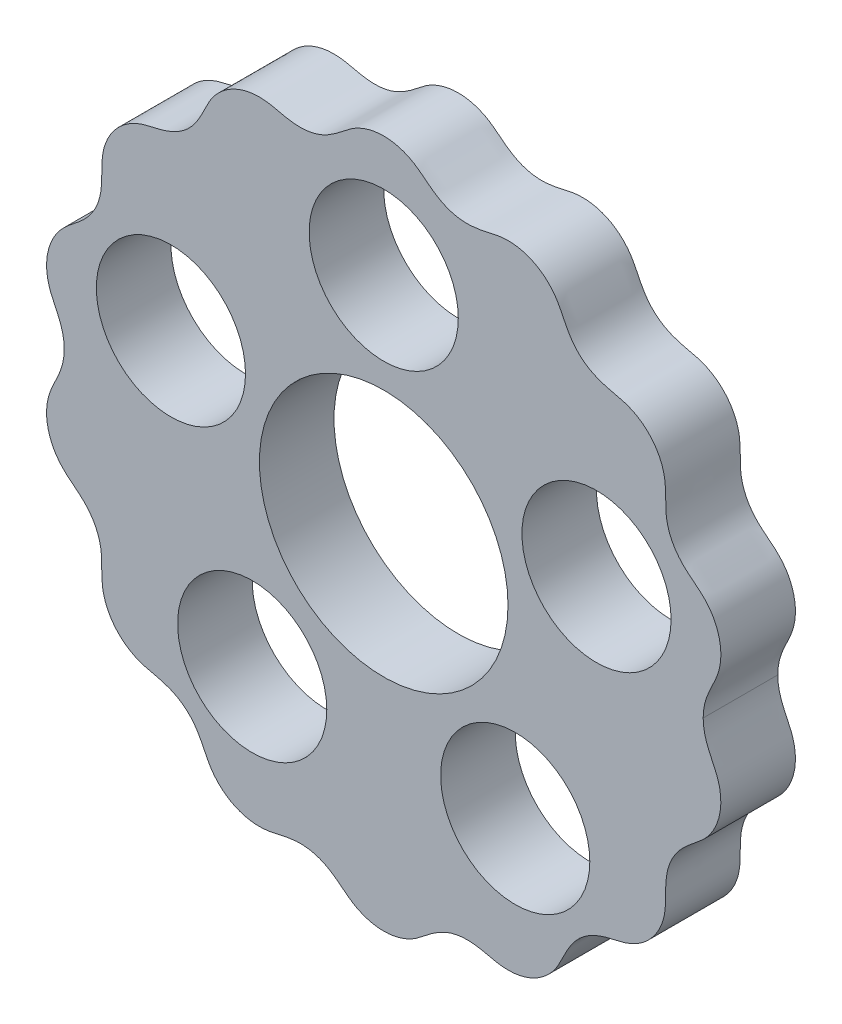
ISO-10303-21;
HEADER;
FILE_DESCRIPTION(('STEP AP214'),'2;1');
FILE_NAME('part.step','',(''),(''),'','','');
FILE_SCHEMA(('AUTOMOTIVE_DESIGN { 1 0 10303 214 1 1 1 1 }'));
ENDSEC;
DATA;
#1=APPLICATION_CONTEXT('core data for automotive mechanical design processes');
#2=APPLICATION_PROTOCOL_DEFINITION('international standard','automotive_design',2000,#1);
#3=PRODUCT_CONTEXT('',#1,'mechanical');
#4=PRODUCT('Part','Part','',(#3));
#5=PRODUCT_RELATED_PRODUCT_CATEGORY('part','',(#4));
#6=PRODUCT_DEFINITION_FORMATION('','',#4);
#7=PRODUCT_DEFINITION_CONTEXT('part definition',#1,'design');
#8=PRODUCT_DEFINITION('design','',#6,#7);
#9=PRODUCT_DEFINITION_SHAPE('','',#8);
#10=(LENGTH_UNIT() NAMED_UNIT(*) SI_UNIT(.MILLI.,.METRE.));
#11=(NAMED_UNIT(*) PLANE_ANGLE_UNIT() SI_UNIT($,.RADIAN.));
#12=(NAMED_UNIT(*) SI_UNIT($,.STERADIAN.) SOLID_ANGLE_UNIT());
#13=UNCERTAINTY_MEASURE_WITH_UNIT(LENGTH_MEASURE(1.E-05),#10,'distance_accuracy_value','');
#14=(GEOMETRIC_REPRESENTATION_CONTEXT(3) GLOBAL_UNCERTAINTY_ASSIGNED_CONTEXT((#13)) GLOBAL_UNIT_ASSIGNED_CONTEXT((#10,
#11,#12)) REPRESENTATION_CONTEXT('',''));
#15=CARTESIAN_POINT('',(0.,0.,0.));
#16=DIRECTION('',(0.,0.,1.));
#17=DIRECTION('',(1.,0.,0.));
#18=AXIS2_PLACEMENT_3D('',#15,#16,#17);
#19=CARTESIAN_POINT('',(-3.08116693157312E-05,14.0000331582625,3.));
#20=DIRECTION('',(0.,0.,1.));
#21=DIRECTION('',(1.,0.,0.));
#22=AXIS2_PLACEMENT_3D('',#19,#20,#21);
#23=PLANE('',#22);
#24=CARTESIAN_POINT('',(0.,0.,3.));
#25=DIRECTION('',(0.,0.,1.));
#26=DIRECTION('',(1.,0.,0.));
#27=AXIS2_PLACEMENT_3D('',#24,#25,#26);
#28=CIRCLE('',#27,5.);
#29=CARTESIAN_POINT('',(5.,0.,3.));
#30=VERTEX_POINT('',#29);
#31=EDGE_CURVE('E105',#30,#30,#28,.T.);
#32=ORIENTED_EDGE('',*,*,#31,.F.);
#33=EDGE_LOOP('',(#32));
#34=FACE_BOUND('',#33,.T.);
#35=CARTESIAN_POINT('',(-8.55950864665612,2.78115294937416,3.));
#36=DIRECTION('',(0.,0.,1.));
#37=DIRECTION('',(1.,0.,0.));
#38=AXIS2_PLACEMENT_3D('',#35,#36,#37);
#39=CIRCLE('',#38,3.00000000000046);
#40=CARTESIAN_POINT('',(-5.55950864665566,2.78115294937416,3.));
#41=VERTEX_POINT('',#40);
#42=EDGE_CURVE('E99',#41,#41,#39,.T.);
#43=ORIENTED_EDGE('',*,*,#42,.F.);
#44=EDGE_LOOP('',(#43));
#45=FACE_BOUND('',#44,.T.);
#46=CARTESIAN_POINT('',(-5.29006727063157,-7.28115294937475,3.));
#47=DIRECTION('',(0.,0.,1.));
#48=DIRECTION('',(1.,0.,0.));
#49=AXIS2_PLACEMENT_3D('',#46,#47,#48);
#50=CIRCLE('',#49,3.0000000000008);
#51=CARTESIAN_POINT('',(-2.29006727063076,-7.28115294937475,3.));
#52=VERTEX_POINT('',#51);
#53=EDGE_CURVE('E130',#52,#52,#50,.T.);
#54=ORIENTED_EDGE('',*,*,#53,.F.);
#55=EDGE_LOOP('',(#54));
#56=FACE_BOUND('',#55,.T.);
#57=CARTESIAN_POINT('',(5.29006727063295,-7.2811529493743,3.));
#58=DIRECTION('',(0.,0.,1.));
#59=DIRECTION('',(1.,0.,0.));
#60=AXIS2_PLACEMENT_3D('',#57,#58,#59);
#61=CIRCLE('',#60,3.00000000000065);
#62=CARTESIAN_POINT('',(8.2900672706336,-7.2811529493743,3.));
#63=VERTEX_POINT('',#62);
#64=EDGE_CURVE('E122',#63,#63,#61,.T.);
#65=ORIENTED_EDGE('',*,*,#64,.F.);
#66=EDGE_LOOP('',(#65));
#67=FACE_BOUND('',#66,.T.);
#68=CARTESIAN_POINT('',(8.55950864665665,2.78115294937489,3.));
#69=DIRECTION('',(0.,0.,1.));
#70=DIRECTION('',(1.,0.,0.));
#71=AXIS2_PLACEMENT_3D('',#68,#69,#70);
#72=CIRCLE('',#71,3.00000000000017);
#73=CARTESIAN_POINT('',(11.5595086466568,2.78115294937489,3.));
#74=VERTEX_POINT('',#73);
#75=EDGE_CURVE('E114',#74,#74,#72,.T.);
#76=ORIENTED_EDGE('',*,*,#75,.F.);
#77=EDGE_LOOP('',(#76));
#78=FACE_BOUND('',#77,.T.);
#79=CARTESIAN_POINT('',(0.,9.,3.));
#80=DIRECTION('',(0.,0.,1.));
#81=DIRECTION('',(1.,0.,0.));
#82=AXIS2_PLACEMENT_3D('',#79,#80,#81);
#83=CIRCLE('',#82,3.);
#84=CARTESIAN_POINT('',(3.,9.,3.));
#85=VERTEX_POINT('',#84);
#86=EDGE_CURVE('E106',#85,#85,#83,.T.);
#87=ORIENTED_EDGE('',*,*,#86,.F.);
#88=EDGE_LOOP('',(#87));
#89=FACE_BOUND('',#88,.T.);
#90=CARTESIAN_POINT('',(-12.8500539384113,3.2306380297552E-12,3.));
#91=CARTESIAN_POINT('',(-12.8501628034038,-0.251481730637626,3.));
#92=CARTESIAN_POINT('',(-12.9400474514801,-0.76310762027659,3.));
#93=CARTESIAN_POINT('',(-13.2805476403468,-1.41673948176034,3.));
#94=CARTESIAN_POINT('',(-13.5334321090351,-2.03483431866077,3.));
#95=CARTESIAN_POINT('',(-13.6076245667252,-2.93149089406617,3.));
#96=CARTESIAN_POINT('',(-13.2933938567163,-3.80527571125432,3.));
#97=CARTESIAN_POINT('',(-12.6605053360641,-4.43011602656103,3.));
#98=CARTESIAN_POINT('',(-12.0700648095173,-4.85369699253959,3.));
#99=CARTESIAN_POINT('',(-11.5876773534212,-5.45683704969,3.));
#100=CARTESIAN_POINT('',(-11.3410601378615,-6.19110966412462,3.));
#101=CARTESIAN_POINT('',(-11.3426921117736,-6.93908053862046,3.));
#102=CARTESIAN_POINT('',(-11.3249212347839,-7.83591629918584,3.));
#103=CARTESIAN_POINT('',(-10.9032517990377,-8.6615297114612,3.));
#104=CARTESIAN_POINT('',(-10.1990762092321,-9.22106105798793,3.));
#105=CARTESIAN_POINT('',(-9.57988602752918,-9.46558919607509,3.));
#106=CARTESIAN_POINT('',(-8.8743069151491,-9.58415587618986,3.));
#107=CARTESIAN_POINT('',(-8.16451400114808,-9.88121416338336,3.));
#108=CARTESIAN_POINT('',(-7.59578704025636,-10.40855055947,3.));
#109=CARTESIAN_POINT('',(-7.24503937718047,-11.0771175069884,3.));
#110=CARTESIAN_POINT('',(-6.95964434383805,-11.6950321768976,3.));
#111=CARTESIAN_POINT('',(-6.5083317362442,-12.1943494941639,3.));
#112=CARTESIAN_POINT('',(-5.93581020323511,-12.5476798211753,3.));
#113=CARTESIAN_POINT('',(-5.28455965408979,-12.7230486161861,3.));
#114=CARTESIAN_POINT('',(-4.61719389365255,-12.7053416228603,3.));
#115=CARTESIAN_POINT('',(-3.94146149406678,-12.5115412972718,3.));
#116=CARTESIAN_POINT('',(-3.17941960593419,-12.4337616023541,3.));
#117=CARTESIAN_POINT('',(-2.42760321440168,-12.6250982152148,3.));
#118=CARTESIAN_POINT('',(-1.7979347419707,-13.0528104572931,3.));
#119=CARTESIAN_POINT('',(-1.2758890835264,-13.5054681138031,3.));
#120=CARTESIAN_POINT('',(-0.666390526633137,-13.785149496984,3.));
#121=CARTESIAN_POINT('',(-0.000146267984430784,-13.8824446995189,3.));
#122=CARTESIAN_POINT('',(0.66667516187485,-13.7852706619507,3.));
#123=CARTESIAN_POINT('',(1.27583739817449,-13.5051733409832,3.));
#124=CARTESIAN_POINT('',(1.79722160324051,-13.0528774215565,3.));
#125=CARTESIAN_POINT('',(2.42799364198644,-12.6252037864453,3.));
#126=CARTESIAN_POINT('',(3.17921525063209,-12.4339751520003,3.));
#127=CARTESIAN_POINT('',(3.9420137854354,-12.510868897191,3.));
#128=CARTESIAN_POINT('',(4.61664296077039,-12.7053845168574,3.));
#129=CARTESIAN_POINT('',(5.28457042550126,-12.7232475423124,3.));
#130=CARTESIAN_POINT('',(5.93590214911907,-12.5475086934171,3.));
#131=CARTESIAN_POINT('',(6.50827069291037,-12.1944470417929,3.));
#132=CARTESIAN_POINT('',(6.9596570102471,-11.6950099245245,3.));
#133=CARTESIAN_POINT('',(7.24505030159331,-11.0771025817506,3.));
#134=CARTESIAN_POINT('',(7.59578230189097,-10.4085603087042,3.));
#135=CARTESIAN_POINT('',(8.16451673907484,-9.88119700035748,3.));
#136=CARTESIAN_POINT('',(8.87431743478499,-9.5841856783052,3.));
#137=CARTESIAN_POINT('',(9.57988726008367,-9.46553434567287,3.));
#138=CARTESIAN_POINT('',(10.1990518500233,-9.2211171506547,3.));
#139=CARTESIAN_POINT('',(10.9033046358121,-8.66146354123981,3.));
#140=CARTESIAN_POINT('',(11.3249040224306,-7.83595522782884,3.));
#141=CARTESIAN_POINT('',(11.3427528441975,-6.93906263827422,3.));
#142=CARTESIAN_POINT('',(11.3410810151036,-6.19113454175132,3.));
#143=CARTESIAN_POINT('',(11.5876733795484,-5.45683081952219,3.));
#144=CARTESIAN_POINT('',(12.0701175752659,-4.8534745142057,3.));
#145=CARTESIAN_POINT('',(12.6602392756659,-4.42970982199975,3.));
#146=CARTESIAN_POINT('',(13.293536242498,-3.8055701598845,3.));
#147=CARTESIAN_POINT('',(13.6075220244743,-2.93141733014582,3.));
#148=CARTESIAN_POINT('',(13.5334903655296,-2.0348705545261,3.));
#149=CARTESIAN_POINT('',(13.2805083707658,-1.41670317984958,3.));
#150=CARTESIAN_POINT('',(12.9400530146406,-0.763117721248707,3.));
#151=CARTESIAN_POINT('',(12.8501698218042,-0.251481435207184,3.));
#152=CARTESIAN_POINT('',(12.8500563480216,-3.96070668548244E-12,3.));
#153=B_SPLINE_CURVE_WITH_KNOTS('',3,(#90,#91,#92,#93,#94,#95,#96,#97,#98,#99,#100,#101,#102,
#103,#104,#105,#106,#107,#108,#109,#110,#111,#112,#113,#114,#115,#116,#117,#118,#119,#120,#121,
#122,#123,#124,#125,#126,#127,#128,#129,#130,#131,#132,#133,#134,#135,#136,#137,#138,#139,#140,
#141,#142,#143,#144,#145,#146,#147,#148,#149,#150,#151,#152),.UNSPECIFIED.,.F.,.F.,(4,1,1,1,1,1,
1,1,1,1,1,1,1,1,1,1,1,1,1,1,1,1,1,1,1,1,1,1,1,1,1,1,1,1,1,1,1,1,1,1,1,1,1,1,1,1,1,1,1,1,1,1,1,1,
1,1,1,1,1,1,4),(0.120527778591699,0.132386285933264,0.14424479327483,0.156103300616395,
0.167961807957961,0.191678822641091,0.203537329982657,0.215395837324222,0.227254344665787,
0.239112852007353,0.250971359348918,0.262829866690484,0.286546881373614,0.29840538871518,
0.310263896056745,0.32212240339831,0.333980910739876,0.345839418081441,0.357697925423007,
0.369556432764572,0.381414940106137,0.393273447447703,0.405131954789268,0.416990462130834,
0.428848969472399,0.440707476813964,0.45256598415553,0.464424491497095,0.47628299883866,
0.488141506180226,0.500000013521791,0.511858520863357,0.523717028204922,0.535575535546487,
0.547434042888053,0.559292550229618,0.571151057571184,0.583009564912749,0.594868072254314,
0.60672657959588,0.618585086937445,0.630443594279011,0.642302101620576,0.654160608962141,
0.666019116303707,0.677877623645272,0.689736130986837,0.701594638328403,0.713453145669968,
0.737170160353099,0.749028667694664,0.76088717503623,0.772745682377795,0.784604189719361,
0.796462697060926,0.808321204402491,0.832038219085622,0.843896726427187,0.855755233768753,
0.867613741110318,0.879472248451884),.UNSPECIFIED.);
#154=CARTESIAN_POINT('',(-12.8500539384113,3.2306380297552E-12,3.));
#155=VERTEX_POINT('',#154);
#156=CARTESIAN_POINT('',(12.8500563480216,-3.96070668548244E-12,3.));
#157=VERTEX_POINT('',#156);
#158=EDGE_CURVE('E73',#155,#157,#153,.T.);
#159=ORIENTED_EDGE('',*,*,#158,.T.);
#160=CARTESIAN_POINT('',(12.8500563480216,-3.96266263014144E-12,3.));
#161=CARTESIAN_POINT('',(12.8501698218076,0.251481435199399,3.));
#162=CARTESIAN_POINT('',(12.9400530146581,0.763117721239817,3.));
#163=CARTESIAN_POINT('',(13.2805083707882,1.41670317983253,3.));
#164=CARTESIAN_POINT('',(13.5334903655436,2.0348705545112,3.));
#165=CARTESIAN_POINT('',(13.6075220244776,2.93141733013161,3.));
#166=CARTESIAN_POINT('',(13.2935362424914,3.80557015986658,3.));
#167=CARTESIAN_POINT('',(12.6602392756509,4.42970982197345,3.));
#168=CARTESIAN_POINT('',(12.0701175752509,4.85347451418654,3.));
#169=CARTESIAN_POINT('',(11.5876733795459,5.45683081951348,3.));
#170=CARTESIAN_POINT('',(11.3410810151166,6.19113454174734,3.));
#171=CARTESIAN_POINT('',(11.3427528442216,6.93906263826681,3.));
#172=CARTESIAN_POINT('',(11.3249040224452,7.83595522781845,3.));
#173=CARTESIAN_POINT('',(10.9033046358173,8.6614635412252,3.));
#174=CARTESIAN_POINT('',(10.1990518500224,9.22111715063234,3.));
#175=CARTESIAN_POINT('',(9.57988726008016,9.46553434564217,3.));
#176=CARTESIAN_POINT('',(8.87431743477797,9.58418567827807,3.));
#177=CARTESIAN_POINT('',(8.16451673907304,9.88119700034487,3.));
#178=CARTESIAN_POINT('',(7.59578230189992,10.4085603087027,3.));
#179=CARTESIAN_POINT('',(7.24505030161424,11.0771025817525,3.));
#180=CARTESIAN_POINT('',(6.95965701026515,11.6950099245214,3.));
#181=CARTESIAN_POINT('',(6.50827069292253,12.1944470417853,3.));
#182=CARTESIAN_POINT('',(5.9359021491278,12.5475086934032,3.));
#183=CARTESIAN_POINT('',(5.28457042550819,12.7232475422918,3.));
#184=CARTESIAN_POINT('',(4.6166429607784,12.705384516829,3.));
#185=CARTESIAN_POINT('',(3.94201378543967,12.5108688971616,3.));
#186=CARTESIAN_POINT('',(3.17921525063393,12.4339751519849,3.));
#187=CARTESIAN_POINT('',(2.42799364199215,12.6252037864441,3.));
#188=CARTESIAN_POINT('',(1.79722160325518,13.0528774215652,3.));
#189=CARTESIAN_POINT('',(1.27583739819042,13.5051733409876,3.));
#190=CARTESIAN_POINT('',(0.666675161887242,13.7852706619487,3.));
#191=CARTESIAN_POINT('',(-0.000146267972563893,13.8824446995104,3.));
#192=CARTESIAN_POINT('',(-0.666390526620414,13.7851494969689,3.));
#193=CARTESIAN_POINT('',(-1.27588908350974,13.5054681137821,3.));
#194=CARTESIAN_POINT('',(-1.7979347419552,13.0528104572683,3.));
#195=CARTESIAN_POINT('',(-2.42760321439447,12.6250982151997,3.));
#196=CARTESIAN_POINT('',(-3.17941960593025,12.4337616023526,3.));
#197=CARTESIAN_POINT('',(-3.94146149406002,12.5115412972835,3.));
#198=CARTESIAN_POINT('',(-4.61719389364197,12.7053416228713,3.));
#199=CARTESIAN_POINT('',(-5.28455965407999,12.7230486161899,3.));
#200=CARTESIAN_POINT('',(-5.93581020322331,12.5476798211735,3.));
#201=CARTESIAN_POINT('',(-6.50833173622919,12.1943494941569,3.));
#202=CARTESIAN_POINT('',(-6.9596443438178,11.695032176887,3.));
#203=CARTESIAN_POINT('',(-7.24503937715784,11.0771175069739,3.));
#204=CARTESIAN_POINT('',(-7.59578704024415,10.4085505594589,3.));
#205=CARTESIAN_POINT('',(-8.16451400114494,9.88121416338223,3.));
#206=CARTESIAN_POINT('',(-8.87430691515009,9.58415587620136,3.));
#207=CARTESIAN_POINT('',(-9.57988602752696,9.46558919608994,3.));
#208=CARTESIAN_POINT('',(-10.1990762092277,9.22106105799642,3.));
#209=CARTESIAN_POINT('',(-10.9032517990283,8.66152971146412,3.));
#210=CARTESIAN_POINT('',(-11.3249212347673,7.83591629918615,3.));
#211=CARTESIAN_POINT('',(-11.3426921117503,6.93908053861883,3.));
#212=CARTESIAN_POINT('',(-11.3410601378472,6.19110966412073,3.));
#213=CARTESIAN_POINT('',(-11.5876773534191,5.45683704969026,3.));
#214=CARTESIAN_POINT('',(-12.0700648095247,4.85369699254836,3.));
#215=CARTESIAN_POINT('',(-12.6605053360716,4.4301160265758,3.));
#216=CARTESIAN_POINT('',(-13.2933938567178,3.80527571126363,3.));
#217=CARTESIAN_POINT('',(-13.6076245667202,2.93149089407362,3.));
#218=CARTESIAN_POINT('',(-13.5334321090233,2.03483431866896,3.));
#219=CARTESIAN_POINT('',(-13.2805476403306,1.41673948177035,3.));
#220=CARTESIAN_POINT('',(-12.9400474514653,0.76310762027991,3.));
#221=CARTESIAN_POINT('',(-12.8501628034058,0.251481730642993,3.));
#222=CARTESIAN_POINT('',(-12.8500539384113,3.23040754414932E-12,3.));
#223=B_SPLINE_CURVE_WITH_KNOTS('',3,(#160,#161,#162,#163,#164,#165,#166,#167,#168,#169,#170,
#171,#172,#173,#174,#175,#176,#177,#178,#179,#180,#181,#182,#183,#184,#185,#186,#187,#188,#189,
#190,#191,#192,#193,#194,#195,#196,#197,#198,#199,#200,#201,#202,#203,#204,#205,#206,#207,#208,
#209,#210,#211,#212,#213,#214,#215,#216,#217,#218,#219,#220,#221,#222),.UNSPECIFIED.,.F.,.F.,(4,
1,1,1,1,1,1,1,1,1,1,1,1,1,1,1,1,1,1,1,1,1,1,1,1,1,1,1,1,1,1,1,1,1,1,1,1,1,1,1,1,1,1,1,1,1,1,1,1,
1,1,1,1,1,1,1,1,1,1,1,4),(0.120527732632473,0.132386239974035,0.144244747315598,
0.15610325465716,0.167961761998722,0.191678776681846,0.203537284023408,0.215395791364971,
0.227254298706533,0.239112806048095,0.250971313389657,0.262829820731219,0.286546835414344,
0.298405342755906,0.310263850097468,0.32212235743903,0.333980864780592,0.345839372122154,
0.357697879463716,0.369556386805279,0.381414894146841,0.393273401488403,0.405131908829965,
0.416990416171527,0.428848923513089,0.440707430854652,0.452565938196214,0.464424445537776,
0.476282952879338,0.4881414602209,0.499999967562462,0.511858474904024,0.523716982245587,
0.535575489587149,0.547433996928711,0.559292504270273,0.571151011611835,0.583009518953397,
0.59486802629496,0.606726533636522,0.618585040978084,0.630443548319646,0.642302055661208,
0.65416056300277,0.666019070344332,0.677877577685895,0.689736085027457,0.701594592369019,
0.713453099710581,0.737170114393706,0.749028621735268,0.76088712907683,0.772745636418392,
0.784604143759954,0.796462651101516,0.808321158443079,0.832038173126203,0.843896680467765,
0.855755187809327,0.867613695150889,0.879472202492451),.UNSPECIFIED.);
#224=EDGE_CURVE('E57',#157,#155,#223,.T.);
#225=ORIENTED_EDGE('',*,*,#224,.T.);
#226=EDGE_LOOP('',(#159,#225));
#227=FACE_BOUND('',#226,.T.);
#228=ADVANCED_FACE('F39',(#34,#45,#56,#67,#78,#89,#227),#23,.T.);
#229=CARTESIAN_POINT('',(-3.08116693157312E-05,14.0000331582625,0.));
#230=DIRECTION('',(0.,0.,1.));
#231=DIRECTION('',(1.,0.,0.));
#232=AXIS2_PLACEMENT_3D('',#229,#230,#231);
#233=PLANE('',#232);
#234=CARTESIAN_POINT('',(0.,0.,0.));
#235=DIRECTION('',(0.,0.,1.));
#236=DIRECTION('',(1.,0.,0.));
#237=AXIS2_PLACEMENT_3D('',#234,#235,#236);
#238=CIRCLE('',#237,5.);
#239=CARTESIAN_POINT('',(5.,0.,0.));
#240=VERTEX_POINT('',#239);
#241=EDGE_CURVE('E144',#240,#240,#238,.T.);
#242=ORIENTED_EDGE('',*,*,#241,.T.);
#243=EDGE_LOOP('',(#242));
#244=FACE_BOUND('',#243,.T.);
#245=CARTESIAN_POINT('',(-8.55950864665612,2.78115294937416,0.));
#246=DIRECTION('',(0.,0.,1.));
#247=DIRECTION('',(1.,0.,0.));
#248=AXIS2_PLACEMENT_3D('',#245,#246,#247);
#249=CIRCLE('',#248,3.00000000000046);
#250=CARTESIAN_POINT('',(-5.55950864665566,2.78115294937416,0.));
#251=VERTEX_POINT('',#250);
#252=EDGE_CURVE('E134',#251,#251,#249,.T.);
#253=ORIENTED_EDGE('',*,*,#252,.T.);
#254=EDGE_LOOP('',(#253));
#255=FACE_BOUND('',#254,.T.);
#256=CARTESIAN_POINT('',(-5.29006727063157,-7.28115294937475,0.));
#257=DIRECTION('',(0.,0.,1.));
#258=DIRECTION('',(1.,0.,0.));
#259=AXIS2_PLACEMENT_3D('',#256,#257,#258);
#260=CIRCLE('',#259,3.0000000000008);
#261=CARTESIAN_POINT('',(-2.29006727063076,-7.28115294937475,0.));
#262=VERTEX_POINT('',#261);
#263=EDGE_CURVE('E126',#262,#262,#260,.T.);
#264=ORIENTED_EDGE('',*,*,#263,.T.);
#265=EDGE_LOOP('',(#264));
#266=FACE_BOUND('',#265,.T.);
#267=CARTESIAN_POINT('',(5.29006727063295,-7.2811529493743,0.));
#268=DIRECTION('',(0.,0.,1.));
#269=DIRECTION('',(1.,0.,0.));
#270=AXIS2_PLACEMENT_3D('',#267,#268,#269);
#271=CIRCLE('',#270,3.00000000000065);
#272=CARTESIAN_POINT('',(8.2900672706336,-7.2811529493743,0.));
#273=VERTEX_POINT('',#272);
#274=EDGE_CURVE('E118',#273,#273,#271,.T.);
#275=ORIENTED_EDGE('',*,*,#274,.T.);
#276=EDGE_LOOP('',(#275));
#277=FACE_BOUND('',#276,.T.);
#278=CARTESIAN_POINT('',(8.55950864665665,2.78115294937489,0.));
#279=DIRECTION('',(0.,0.,1.));
#280=DIRECTION('',(1.,0.,0.));
#281=AXIS2_PLACEMENT_3D('',#278,#279,#280);
#282=CIRCLE('',#281,3.00000000000017);
#283=CARTESIAN_POINT('',(11.5595086466568,2.78115294937489,0.));
#284=VERTEX_POINT('',#283);
#285=EDGE_CURVE('E110',#284,#284,#282,.T.);
#286=ORIENTED_EDGE('',*,*,#285,.T.);
#287=EDGE_LOOP('',(#286));
#288=FACE_BOUND('',#287,.T.);
#289=CARTESIAN_POINT('',(0.,9.,0.));
#290=DIRECTION('',(0.,0.,1.));
#291=DIRECTION('',(1.,0.,0.));
#292=AXIS2_PLACEMENT_3D('',#289,#290,#291);
#293=CIRCLE('',#292,3.);
#294=CARTESIAN_POINT('',(3.,9.,0.));
#295=VERTEX_POINT('',#294);
#296=EDGE_CURVE('E101',#295,#295,#293,.T.);
#297=ORIENTED_EDGE('',*,*,#296,.T.);
#298=EDGE_LOOP('',(#297));
#299=FACE_BOUND('',#298,.T.);
#300=CARTESIAN_POINT('',(12.8500563480216,-3.96266263014144E-12,0.));
#301=CARTESIAN_POINT('',(12.8501698218076,0.251481435199399,0.));
#302=CARTESIAN_POINT('',(12.9400530146581,0.763117721239817,0.));
#303=CARTESIAN_POINT('',(13.2805083707882,1.41670317983253,0.));
#304=CARTESIAN_POINT('',(13.5334903655436,2.0348705545112,0.));
#305=CARTESIAN_POINT('',(13.6075220244776,2.93141733013161,0.));
#306=CARTESIAN_POINT('',(13.2935362424914,3.80557015986658,0.));
#307=CARTESIAN_POINT('',(12.6602392756509,4.42970982197345,0.));
#308=CARTESIAN_POINT('',(12.0701175752509,4.85347451418654,0.));
#309=CARTESIAN_POINT('',(11.5876733795459,5.45683081951348,0.));
#310=CARTESIAN_POINT('',(11.3410810151166,6.19113454174734,0.));
#311=CARTESIAN_POINT('',(11.3427528442216,6.93906263826681,0.));
#312=CARTESIAN_POINT('',(11.3249040224452,7.83595522781845,0.));
#313=CARTESIAN_POINT('',(10.9033046358173,8.6614635412252,0.));
#314=CARTESIAN_POINT('',(10.1990518500224,9.22111715063234,0.));
#315=CARTESIAN_POINT('',(9.57988726008016,9.46553434564217,0.));
#316=CARTESIAN_POINT('',(8.87431743477797,9.58418567827807,0.));
#317=CARTESIAN_POINT('',(8.16451673907304,9.88119700034487,0.));
#318=CARTESIAN_POINT('',(7.59578230189992,10.4085603087027,0.));
#319=CARTESIAN_POINT('',(7.24505030161424,11.0771025817525,0.));
#320=CARTESIAN_POINT('',(6.95965701026515,11.6950099245214,0.));
#321=CARTESIAN_POINT('',(6.50827069292253,12.1944470417853,0.));
#322=CARTESIAN_POINT('',(5.9359021491278,12.5475086934032,0.));
#323=CARTESIAN_POINT('',(5.28457042550819,12.7232475422918,0.));
#324=CARTESIAN_POINT('',(4.6166429607784,12.705384516829,0.));
#325=CARTESIAN_POINT('',(3.94201378543967,12.5108688971616,0.));
#326=CARTESIAN_POINT('',(3.17921525063393,12.4339751519849,0.));
#327=CARTESIAN_POINT('',(2.42799364199215,12.6252037864441,0.));
#328=CARTESIAN_POINT('',(1.79722160325518,13.0528774215652,0.));
#329=CARTESIAN_POINT('',(1.27583739819042,13.5051733409876,0.));
#330=CARTESIAN_POINT('',(0.666675161887242,13.7852706619487,0.));
#331=CARTESIAN_POINT('',(-0.000146267972563893,13.8824446995104,0.));
#332=CARTESIAN_POINT('',(-0.666390526620414,13.7851494969689,0.));
#333=CARTESIAN_POINT('',(-1.27588908350974,13.5054681137821,0.));
#334=CARTESIAN_POINT('',(-1.7979347419552,13.0528104572683,0.));
#335=CARTESIAN_POINT('',(-2.42760321439447,12.6250982151997,0.));
#336=CARTESIAN_POINT('',(-3.17941960593025,12.4337616023526,0.));
#337=CARTESIAN_POINT('',(-3.94146149406002,12.5115412972835,0.));
#338=CARTESIAN_POINT('',(-4.61719389364197,12.7053416228713,0.));
#339=CARTESIAN_POINT('',(-5.28455965407999,12.7230486161899,0.));
#340=CARTESIAN_POINT('',(-5.93581020322331,12.5476798211735,0.));
#341=CARTESIAN_POINT('',(-6.50833173622919,12.1943494941569,0.));
#342=CARTESIAN_POINT('',(-6.9596443438178,11.695032176887,0.));
#343=CARTESIAN_POINT('',(-7.24503937715784,11.0771175069739,0.));
#344=CARTESIAN_POINT('',(-7.59578704024415,10.4085505594589,0.));
#345=CARTESIAN_POINT('',(-8.16451400114494,9.88121416338223,0.));
#346=CARTESIAN_POINT('',(-8.87430691515009,9.58415587620136,0.));
#347=CARTESIAN_POINT('',(-9.57988602752696,9.46558919608994,0.));
#348=CARTESIAN_POINT('',(-10.1990762092277,9.22106105799642,0.));
#349=CARTESIAN_POINT('',(-10.9032517990283,8.66152971146412,0.));
#350=CARTESIAN_POINT('',(-11.3249212347673,7.83591629918615,0.));
#351=CARTESIAN_POINT('',(-11.3426921117503,6.93908053861883,0.));
#352=CARTESIAN_POINT('',(-11.3410601378472,6.19110966412073,0.));
#353=CARTESIAN_POINT('',(-11.5876773534191,5.45683704969026,0.));
#354=CARTESIAN_POINT('',(-12.0700648095247,4.85369699254836,0.));
#355=CARTESIAN_POINT('',(-12.6605053360716,4.4301160265758,0.));
#356=CARTESIAN_POINT('',(-13.2933938567178,3.80527571126363,0.));
#357=CARTESIAN_POINT('',(-13.6076245667202,2.93149089407362,0.));
#358=CARTESIAN_POINT('',(-13.5334321090233,2.03483431866896,0.));
#359=CARTESIAN_POINT('',(-13.2805476403306,1.41673948177035,0.));
#360=CARTESIAN_POINT('',(-12.9400474514653,0.76310762027991,0.));
#361=CARTESIAN_POINT('',(-12.8501628034058,0.251481730642993,0.));
#362=CARTESIAN_POINT('',(-12.8500539384113,3.23040754414932E-12,0.));
#363=B_SPLINE_CURVE_WITH_KNOTS('',3,(#300,#301,#302,#303,#304,#305,#306,#307,#308,#309,#310,
#311,#312,#313,#314,#315,#316,#317,#318,#319,#320,#321,#322,#323,#324,#325,#326,#327,#328,#329,
#330,#331,#332,#333,#334,#335,#336,#337,#338,#339,#340,#341,#342,#343,#344,#345,#346,#347,#348,
#349,#350,#351,#352,#353,#354,#355,#356,#357,#358,#359,#360,#361,#362),.UNSPECIFIED.,.F.,.F.,(4,
1,1,1,1,1,1,1,1,1,1,1,1,1,1,1,1,1,1,1,1,1,1,1,1,1,1,1,1,1,1,1,1,1,1,1,1,1,1,1,1,1,1,1,1,1,1,1,1,
1,1,1,1,1,1,1,1,1,1,1,4),(0.120527732632473,0.132386239974035,0.144244747315598,
0.15610325465716,0.167961761998722,0.191678776681846,0.203537284023408,0.215395791364971,
0.227254298706533,0.239112806048095,0.250971313389657,0.262829820731219,0.286546835414344,
0.298405342755906,0.310263850097468,0.32212235743903,0.333980864780592,0.345839372122154,
0.357697879463716,0.369556386805279,0.381414894146841,0.393273401488403,0.405131908829965,
0.416990416171527,0.428848923513089,0.440707430854652,0.452565938196214,0.464424445537776,
0.476282952879338,0.4881414602209,0.499999967562462,0.511858474904024,0.523716982245587,
0.535575489587149,0.547433996928711,0.559292504270273,0.571151011611835,0.583009518953397,
0.59486802629496,0.606726533636522,0.618585040978084,0.630443548319646,0.642302055661208,
0.65416056300277,0.666019070344332,0.677877577685895,0.689736085027457,0.701594592369019,
0.713453099710581,0.737170114393706,0.749028621735268,0.76088712907683,0.772745636418392,
0.784604143759954,0.796462651101516,0.808321158443079,0.832038173126203,0.843896680467765,
0.855755187809327,0.867613695150889,0.879472202492451),.UNSPECIFIED.);
#364=CARTESIAN_POINT('',(12.8500563480216,-3.96070668548244E-12,0.));
#365=VERTEX_POINT('',#364);
#366=CARTESIAN_POINT('',(-12.8500539384113,3.2306380297552E-12,0.));
#367=VERTEX_POINT('',#366);
#368=EDGE_CURVE('E11',#365,#367,#363,.T.);
#369=ORIENTED_EDGE('',*,*,#368,.F.);
#370=CARTESIAN_POINT('',(-12.8500539384113,3.2306380297552E-12,0.));
#371=CARTESIAN_POINT('',(-12.8501628034038,-0.251481730637626,0.));
#372=CARTESIAN_POINT('',(-12.9400474514801,-0.76310762027659,0.));
#373=CARTESIAN_POINT('',(-13.2805476403468,-1.41673948176034,0.));
#374=CARTESIAN_POINT('',(-13.5334321090351,-2.03483431866077,0.));
#375=CARTESIAN_POINT('',(-13.6076245667252,-2.93149089406617,0.));
#376=CARTESIAN_POINT('',(-13.2933938567163,-3.80527571125432,0.));
#377=CARTESIAN_POINT('',(-12.6605053360641,-4.43011602656103,0.));
#378=CARTESIAN_POINT('',(-12.0700648095173,-4.85369699253959,0.));
#379=CARTESIAN_POINT('',(-11.5876773534212,-5.45683704969,0.));
#380=CARTESIAN_POINT('',(-11.3410601378615,-6.19110966412462,0.));
#381=CARTESIAN_POINT('',(-11.3426921117736,-6.93908053862046,0.));
#382=CARTESIAN_POINT('',(-11.3249212347839,-7.83591629918584,0.));
#383=CARTESIAN_POINT('',(-10.9032517990377,-8.6615297114612,0.));
#384=CARTESIAN_POINT('',(-10.1990762092321,-9.22106105798793,0.));
#385=CARTESIAN_POINT('',(-9.57988602752918,-9.46558919607509,0.));
#386=CARTESIAN_POINT('',(-8.8743069151491,-9.58415587618986,0.));
#387=CARTESIAN_POINT('',(-8.16451400114808,-9.88121416338336,0.));
#388=CARTESIAN_POINT('',(-7.59578704025636,-10.40855055947,0.));
#389=CARTESIAN_POINT('',(-7.24503937718047,-11.0771175069884,0.));
#390=CARTESIAN_POINT('',(-6.95964434383805,-11.6950321768976,0.));
#391=CARTESIAN_POINT('',(-6.5083317362442,-12.1943494941639,0.));
#392=CARTESIAN_POINT('',(-5.93581020323511,-12.5476798211753,0.));
#393=CARTESIAN_POINT('',(-5.28455965408979,-12.7230486161861,0.));
#394=CARTESIAN_POINT('',(-4.61719389365255,-12.7053416228603,0.));
#395=CARTESIAN_POINT('',(-3.94146149406678,-12.5115412972718,0.));
#396=CARTESIAN_POINT('',(-3.17941960593419,-12.4337616023541,0.));
#397=CARTESIAN_POINT('',(-2.42760321440168,-12.6250982152148,0.));
#398=CARTESIAN_POINT('',(-1.7979347419707,-13.0528104572931,0.));
#399=CARTESIAN_POINT('',(-1.2758890835264,-13.5054681138031,0.));
#400=CARTESIAN_POINT('',(-0.666390526633137,-13.785149496984,0.));
#401=CARTESIAN_POINT('',(-0.000146267984430784,-13.8824446995189,0.));
#402=CARTESIAN_POINT('',(0.66667516187485,-13.7852706619507,0.));
#403=CARTESIAN_POINT('',(1.27583739817449,-13.5051733409832,0.));
#404=CARTESIAN_POINT('',(1.79722160324051,-13.0528774215565,0.));
#405=CARTESIAN_POINT('',(2.42799364198644,-12.6252037864453,0.));
#406=CARTESIAN_POINT('',(3.17921525063209,-12.4339751520003,0.));
#407=CARTESIAN_POINT('',(3.9420137854354,-12.510868897191,0.));
#408=CARTESIAN_POINT('',(4.61664296077039,-12.7053845168574,0.));
#409=CARTESIAN_POINT('',(5.28457042550126,-12.7232475423124,0.));
#410=CARTESIAN_POINT('',(5.93590214911907,-12.5475086934171,0.));
#411=CARTESIAN_POINT('',(6.50827069291037,-12.1944470417929,0.));
#412=CARTESIAN_POINT('',(6.9596570102471,-11.6950099245245,0.));
#413=CARTESIAN_POINT('',(7.24505030159331,-11.0771025817506,0.));
#414=CARTESIAN_POINT('',(7.59578230189097,-10.4085603087042,0.));
#415=CARTESIAN_POINT('',(8.16451673907484,-9.88119700035748,0.));
#416=CARTESIAN_POINT('',(8.87431743478499,-9.5841856783052,0.));
#417=CARTESIAN_POINT('',(9.57988726008367,-9.46553434567287,0.));
#418=CARTESIAN_POINT('',(10.1990518500233,-9.2211171506547,0.));
#419=CARTESIAN_POINT('',(10.9033046358121,-8.66146354123981,0.));
#420=CARTESIAN_POINT('',(11.3249040224306,-7.83595522782884,0.));
#421=CARTESIAN_POINT('',(11.3427528441975,-6.93906263827422,0.));
#422=CARTESIAN_POINT('',(11.3410810151036,-6.19113454175132,0.));
#423=CARTESIAN_POINT('',(11.5876733795484,-5.45683081952219,0.));
#424=CARTESIAN_POINT('',(12.0701175752659,-4.8534745142057,0.));
#425=CARTESIAN_POINT('',(12.6602392756659,-4.42970982199975,0.));
#426=CARTESIAN_POINT('',(13.293536242498,-3.8055701598845,0.));
#427=CARTESIAN_POINT('',(13.6075220244743,-2.93141733014582,0.));
#428=CARTESIAN_POINT('',(13.5334903655296,-2.0348705545261,0.));
#429=CARTESIAN_POINT('',(13.2805083707658,-1.41670317984958,0.));
#430=CARTESIAN_POINT('',(12.9400530146406,-0.763117721248707,0.));
#431=CARTESIAN_POINT('',(12.8501698218042,-0.251481435207184,0.));
#432=CARTESIAN_POINT('',(12.8500563480216,-3.96070668548244E-12,0.));
#433=B_SPLINE_CURVE_WITH_KNOTS('',3,(#370,#371,#372,#373,#374,#375,#376,#377,#378,#379,#380,
#381,#382,#383,#384,#385,#386,#387,#388,#389,#390,#391,#392,#393,#394,#395,#396,#397,#398,#399,
#400,#401,#402,#403,#404,#405,#406,#407,#408,#409,#410,#411,#412,#413,#414,#415,#416,#417,#418,
#419,#420,#421,#422,#423,#424,#425,#426,#427,#428,#429,#430,#431,#432),.UNSPECIFIED.,.F.,.F.,(4,
1,1,1,1,1,1,1,1,1,1,1,1,1,1,1,1,1,1,1,1,1,1,1,1,1,1,1,1,1,1,1,1,1,1,1,1,1,1,1,1,1,1,1,1,1,1,1,1,
1,1,1,1,1,1,1,1,1,1,1,4),(0.120527778591699,0.132386285933264,0.14424479327483,
0.156103300616395,0.167961807957961,0.191678822641091,0.203537329982657,0.215395837324222,
0.227254344665787,0.239112852007353,0.250971359348918,0.262829866690484,0.286546881373614,
0.29840538871518,0.310263896056745,0.32212240339831,0.333980910739876,0.345839418081441,
0.357697925423007,0.369556432764572,0.381414940106137,0.393273447447703,0.405131954789268,
0.416990462130834,0.428848969472399,0.440707476813964,0.45256598415553,0.464424491497095,
0.47628299883866,0.488141506180226,0.500000013521791,0.511858520863357,0.523717028204922,
0.535575535546487,0.547434042888053,0.559292550229618,0.571151057571184,0.583009564912749,
0.594868072254314,0.60672657959588,0.618585086937445,0.630443594279011,0.642302101620576,
0.654160608962141,0.666019116303707,0.677877623645272,0.689736130986837,0.701594638328403,
0.713453145669968,0.737170160353099,0.749028667694664,0.76088717503623,0.772745682377795,
0.784604189719361,0.796462697060926,0.808321204402491,0.832038219085622,0.843896726427187,
0.855755233768753,0.867613741110318,0.879472248451884),.UNSPECIFIED.);
#434=EDGE_CURVE('E50',#367,#365,#433,.T.);
#435=ORIENTED_EDGE('',*,*,#434,.F.);
#436=EDGE_LOOP('',(#369,#435));
#437=FACE_BOUND('',#436,.T.);
#438=ADVANCED_FACE('F41',(#244,#255,#266,#277,#288,#299,#437),#233,.F.);
#439=CARTESIAN_POINT('',(0.,0.,-5.));
#440=DIRECTION('',(0.,0.,1.));
#441=DIRECTION('',(1.,0.,0.));
#442=AXIS2_PLACEMENT_3D('',#439,#440,#441);
#443=CYLINDRICAL_SURFACE('',#442,5.);
#444=ORIENTED_EDGE('',*,*,#31,.T.);
#445=EDGE_LOOP('',(#444));
#446=FACE_BOUND('',#445,.T.);
#447=ORIENTED_EDGE('',*,*,#241,.F.);
#448=EDGE_LOOP('',(#447));
#449=FACE_BOUND('',#448,.T.);
#450=ADVANCED_FACE('F155',(#446,#449),#443,.F.);
#451=CARTESIAN_POINT('',(-8.55950864665612,2.78115294937416,0.));
#452=DIRECTION('',(0.,0.,1.));
#453=DIRECTION('',(1.,0.,0.));
#454=AXIS2_PLACEMENT_3D('',#451,#452,#453);
#455=CYLINDRICAL_SURFACE('',#454,3.00000000000046);
#456=ORIENTED_EDGE('',*,*,#252,.F.);
#457=EDGE_LOOP('',(#456));
#458=FACE_BOUND('',#457,.T.);
#459=ORIENTED_EDGE('',*,*,#42,.T.);
#460=EDGE_LOOP('',(#459));
#461=FACE_BOUND('',#460,.T.);
#462=ADVANCED_FACE('F161',(#458,#461),#455,.F.);
#463=CARTESIAN_POINT('',(-5.29006727063157,-7.28115294937475,0.));
#464=DIRECTION('',(0.,0.,1.));
#465=DIRECTION('',(1.,0.,0.));
#466=AXIS2_PLACEMENT_3D('',#463,#464,#465);
#467=CYLINDRICAL_SURFACE('',#466,3.0000000000008);
#468=ORIENTED_EDGE('',*,*,#263,.F.);
#469=EDGE_LOOP('',(#468));
#470=FACE_BOUND('',#469,.T.);
#471=ORIENTED_EDGE('',*,*,#53,.T.);
#472=EDGE_LOOP('',(#471));
#473=FACE_BOUND('',#472,.T.);
#474=ADVANCED_FACE('F196',(#470,#473),#467,.F.);
#475=CARTESIAN_POINT('',(5.29006727063295,-7.2811529493743,0.));
#476=DIRECTION('',(0.,0.,1.));
#477=DIRECTION('',(1.,0.,0.));
#478=AXIS2_PLACEMENT_3D('',#475,#476,#477);
#479=CYLINDRICAL_SURFACE('',#478,3.00000000000065);
#480=ORIENTED_EDGE('',*,*,#274,.F.);
#481=EDGE_LOOP('',(#480));
#482=FACE_BOUND('',#481,.T.);
#483=ORIENTED_EDGE('',*,*,#64,.T.);
#484=EDGE_LOOP('',(#483));
#485=FACE_BOUND('',#484,.T.);
#486=ADVANCED_FACE('F189',(#482,#485),#479,.F.);
#487=CARTESIAN_POINT('',(8.55950864665665,2.78115294937489,0.));
#488=DIRECTION('',(0.,0.,1.));
#489=DIRECTION('',(1.,0.,0.));
#490=AXIS2_PLACEMENT_3D('',#487,#488,#489);
#491=CYLINDRICAL_SURFACE('',#490,3.00000000000017);
#492=ORIENTED_EDGE('',*,*,#285,.F.);
#493=EDGE_LOOP('',(#492));
#494=FACE_BOUND('',#493,.T.);
#495=ORIENTED_EDGE('',*,*,#75,.T.);
#496=EDGE_LOOP('',(#495));
#497=FACE_BOUND('',#496,.T.);
#498=ADVANCED_FACE('F180',(#494,#497),#491,.F.);
#499=CARTESIAN_POINT('',(0.,9.,0.));
#500=DIRECTION('',(0.,0.,1.));
#501=DIRECTION('',(1.,0.,0.));
#502=AXIS2_PLACEMENT_3D('',#499,#500,#501);
#503=CYLINDRICAL_SURFACE('',#502,3.);
#504=ORIENTED_EDGE('',*,*,#296,.F.);
#505=EDGE_LOOP('',(#504));
#506=FACE_BOUND('',#505,.T.);
#507=ORIENTED_EDGE('',*,*,#86,.T.);
#508=EDGE_LOOP('',(#507));
#509=FACE_BOUND('',#508,.T.);
#510=ADVANCED_FACE('F177',(#506,#509),#503,.F.);
#511=CARTESIAN_POINT('',(12.8500563480216,-3.96266263014144E-12,-7.));
#512=CARTESIAN_POINT('',(12.8501698218076,0.251481435199399,-7.));
#513=CARTESIAN_POINT('',(12.9400530146581,0.763117721239817,-7.));
#514=CARTESIAN_POINT('',(13.2805083707882,1.41670317983253,-7.));
#515=CARTESIAN_POINT('',(13.5334903655436,2.0348705545112,-7.));
#516=CARTESIAN_POINT('',(13.6075220244776,2.93141733013161,-7.));
#517=CARTESIAN_POINT('',(13.2935362424914,3.80557015986658,-7.));
#518=CARTESIAN_POINT('',(12.6602392756509,4.42970982197345,-7.));
#519=CARTESIAN_POINT('',(12.0701175752509,4.85347451418654,-7.));
#520=CARTESIAN_POINT('',(11.5876733795459,5.45683081951348,-7.));
#521=CARTESIAN_POINT('',(11.3410810151166,6.19113454174734,-7.));
#522=CARTESIAN_POINT('',(11.3427528442216,6.93906263826681,-7.));
#523=CARTESIAN_POINT('',(11.3249040224452,7.83595522781845,-7.));
#524=CARTESIAN_POINT('',(10.9033046358173,8.6614635412252,-7.));
#525=CARTESIAN_POINT('',(10.1990518500224,9.22111715063234,-7.));
#526=CARTESIAN_POINT('',(9.57988726008016,9.46553434564217,-7.));
#527=CARTESIAN_POINT('',(8.87431743477797,9.58418567827807,-7.));
#528=CARTESIAN_POINT('',(8.16451673907304,9.88119700034487,-7.));
#529=CARTESIAN_POINT('',(7.59578230189992,10.4085603087027,-7.));
#530=CARTESIAN_POINT('',(7.24505030161424,11.0771025817525,-7.));
#531=CARTESIAN_POINT('',(6.95965701026515,11.6950099245214,-7.));
#532=CARTESIAN_POINT('',(6.50827069292253,12.1944470417853,-7.));
#533=CARTESIAN_POINT('',(5.9359021491278,12.5475086934032,-7.));
#534=CARTESIAN_POINT('',(5.28457042550819,12.7232475422918,-7.));
#535=CARTESIAN_POINT('',(4.6166429607784,12.705384516829,-7.));
#536=CARTESIAN_POINT('',(3.94201378543967,12.5108688971616,-7.));
#537=CARTESIAN_POINT('',(3.17921525063393,12.4339751519849,-7.));
#538=CARTESIAN_POINT('',(2.42799364199215,12.6252037864441,-7.));
#539=CARTESIAN_POINT('',(1.79722160325518,13.0528774215652,-7.));
#540=CARTESIAN_POINT('',(1.27583739819042,13.5051733409876,-7.));
#541=CARTESIAN_POINT('',(0.666675161887242,13.7852706619487,-7.));
#542=CARTESIAN_POINT('',(-0.000146267972563893,13.8824446995104,-7.));
#543=CARTESIAN_POINT('',(-0.666390526620414,13.7851494969689,-7.));
#544=CARTESIAN_POINT('',(-1.27588908350974,13.5054681137821,-7.));
#545=CARTESIAN_POINT('',(-1.7979347419552,13.0528104572683,-7.));
#546=CARTESIAN_POINT('',(-2.42760321439447,12.6250982151997,-7.));
#547=CARTESIAN_POINT('',(-3.17941960593025,12.4337616023526,-7.));
#548=CARTESIAN_POINT('',(-3.94146149406002,12.5115412972835,-7.));
#549=CARTESIAN_POINT('',(-4.61719389364197,12.7053416228713,-7.));
#550=CARTESIAN_POINT('',(-5.28455965407999,12.7230486161899,-7.));
#551=CARTESIAN_POINT('',(-5.93581020322331,12.5476798211735,-7.));
#552=CARTESIAN_POINT('',(-6.50833173622919,12.1943494941569,-7.));
#553=CARTESIAN_POINT('',(-6.9596443438178,11.695032176887,-7.));
#554=CARTESIAN_POINT('',(-7.24503937715784,11.0771175069739,-7.));
#555=CARTESIAN_POINT('',(-7.59578704024415,10.4085505594589,-7.));
#556=CARTESIAN_POINT('',(-8.16451400114494,9.88121416338223,-7.));
#557=CARTESIAN_POINT('',(-8.87430691515009,9.58415587620136,-7.));
#558=CARTESIAN_POINT('',(-9.57988602752696,9.46558919608994,-7.));
#559=CARTESIAN_POINT('',(-10.1990762092277,9.22106105799642,-7.));
#560=CARTESIAN_POINT('',(-10.9032517990283,8.66152971146412,-7.));
#561=CARTESIAN_POINT('',(-11.3249212347673,7.83591629918615,-7.));
#562=CARTESIAN_POINT('',(-11.3426921117503,6.93908053861883,-7.));
#563=CARTESIAN_POINT('',(-11.3410601378472,6.19110966412073,-7.));
#564=CARTESIAN_POINT('',(-11.5876773534191,5.45683704969026,-7.));
#565=CARTESIAN_POINT('',(-12.0700648095247,4.85369699254836,-7.));
#566=CARTESIAN_POINT('',(-12.6605053360716,4.4301160265758,-7.));
#567=CARTESIAN_POINT('',(-13.2933938567178,3.80527571126363,-7.));
#568=CARTESIAN_POINT('',(-13.6076245667202,2.93149089407362,-7.));
#569=CARTESIAN_POINT('',(-13.5334321090233,2.03483431866896,-7.));
#570=CARTESIAN_POINT('',(-13.2805476403306,1.41673948177035,-7.));
#571=CARTESIAN_POINT('',(-12.9400474514653,0.76310762027991,-7.));
#572=CARTESIAN_POINT('',(-12.8501628034058,0.251481730642993,-7.));
#573=CARTESIAN_POINT('',(-12.8500539384113,3.23040754414932E-12,-7.));
#574=B_SPLINE_CURVE_WITH_KNOTS('',3,(#511,#512,#513,#514,#515,#516,#517,#518,#519,#520,#521,
#522,#523,#524,#525,#526,#527,#528,#529,#530,#531,#532,#533,#534,#535,#536,#537,#538,#539,#540,
#541,#542,#543,#544,#545,#546,#547,#548,#549,#550,#551,#552,#553,#554,#555,#556,#557,#558,#559,
#560,#561,#562,#563,#564,#565,#566,#567,#568,#569,#570,#571,#572,#573),.UNSPECIFIED.,.F.,.F.,(4,
1,1,1,1,1,1,1,1,1,1,1,1,1,1,1,1,1,1,1,1,1,1,1,1,1,1,1,1,1,1,1,1,1,1,1,1,1,1,1,1,1,1,1,1,1,1,1,1,
1,1,1,1,1,1,1,1,1,1,1,4),(0.120527732632473,0.132386239974035,0.144244747315598,
0.15610325465716,0.167961761998722,0.191678776681846,0.203537284023408,0.215395791364971,
0.227254298706533,0.239112806048095,0.250971313389657,0.262829820731219,0.286546835414344,
0.298405342755906,0.310263850097468,0.32212235743903,0.333980864780592,0.345839372122154,
0.357697879463716,0.369556386805279,0.381414894146841,0.393273401488403,0.405131908829965,
0.416990416171527,0.428848923513089,0.440707430854652,0.452565938196214,0.464424445537776,
0.476282952879338,0.4881414602209,0.499999967562462,0.511858474904024,0.523716982245587,
0.535575489587149,0.547433996928711,0.559292504270273,0.571151011611835,0.583009518953397,
0.59486802629496,0.606726533636522,0.618585040978084,0.630443548319646,0.642302055661208,
0.65416056300277,0.666019070344332,0.677877577685895,0.689736085027457,0.701594592369019,
0.713453099710581,0.737170114393706,0.749028621735268,0.76088712907683,0.772745636418392,
0.784604143759954,0.796462651101516,0.808321158443079,0.832038173126203,0.843896680467765,
0.855755187809327,0.867613695150889,0.879472202492451),.UNSPECIFIED.);
#575=DIRECTION('',(0.,0.,1.));
#576=VECTOR('',#575,1.);
#577=SURFACE_OF_LINEAR_EXTRUSION('',#574,#576);
#578=ORIENTED_EDGE('',*,*,#368,.T.);
#579=DIRECTION('',(0.,0.,1.));
#580=VECTOR('',#579,1.);
#581=CARTESIAN_POINT('',(-12.8500539384113,3.2306380297552E-12,-7.));
#582=LINE('',#581,#580);
#583=EDGE_CURVE('E64',#367,#155,#582,.T.);
#584=ORIENTED_EDGE('',*,*,#583,.T.);
#585=ORIENTED_EDGE('',*,*,#224,.F.);
#586=DIRECTION('',(0.,0.,1.));
#587=VECTOR('',#586,1.);
#588=CARTESIAN_POINT('',(12.8500563480216,-3.96070668548244E-12,-7.));
#589=LINE('',#588,#587);
#590=EDGE_CURVE('E72',#365,#157,#589,.T.);
#591=ORIENTED_EDGE('',*,*,#590,.F.);
#592=EDGE_LOOP('',(#578,#584,#585,#591));
#593=FACE_BOUND('',#592,.T.);
#594=ADVANCED_FACE('F68',(#593),#577,.T.);
#595=CARTESIAN_POINT('',(-12.8500539384113,3.2306380297552E-12,-7.));
#596=CARTESIAN_POINT('',(-12.8501628034038,-0.251481730637626,-7.));
#597=CARTESIAN_POINT('',(-12.9400474514801,-0.76310762027659,-7.));
#598=CARTESIAN_POINT('',(-13.2805476403468,-1.41673948176034,-7.));
#599=CARTESIAN_POINT('',(-13.5334321090351,-2.03483431866077,-7.));
#600=CARTESIAN_POINT('',(-13.6076245667252,-2.93149089406617,-7.));
#601=CARTESIAN_POINT('',(-13.2933938567163,-3.80527571125432,-7.));
#602=CARTESIAN_POINT('',(-12.6605053360641,-4.43011602656103,-7.));
#603=CARTESIAN_POINT('',(-12.0700648095173,-4.85369699253959,-7.));
#604=CARTESIAN_POINT('',(-11.5876773534212,-5.45683704969,-7.));
#605=CARTESIAN_POINT('',(-11.3410601378615,-6.19110966412462,-7.));
#606=CARTESIAN_POINT('',(-11.3426921117736,-6.93908053862046,-7.));
#607=CARTESIAN_POINT('',(-11.3249212347839,-7.83591629918584,-7.));
#608=CARTESIAN_POINT('',(-10.9032517990377,-8.6615297114612,-7.));
#609=CARTESIAN_POINT('',(-10.1990762092321,-9.22106105798793,-7.));
#610=CARTESIAN_POINT('',(-9.57988602752918,-9.46558919607509,-7.));
#611=CARTESIAN_POINT('',(-8.8743069151491,-9.58415587618986,-7.));
#612=CARTESIAN_POINT('',(-8.16451400114808,-9.88121416338336,-7.));
#613=CARTESIAN_POINT('',(-7.59578704025636,-10.40855055947,-7.));
#614=CARTESIAN_POINT('',(-7.24503937718047,-11.0771175069884,-7.));
#615=CARTESIAN_POINT('',(-6.95964434383805,-11.6950321768976,-7.));
#616=CARTESIAN_POINT('',(-6.5083317362442,-12.1943494941639,-7.));
#617=CARTESIAN_POINT('',(-5.93581020323511,-12.5476798211753,-7.));
#618=CARTESIAN_POINT('',(-5.28455965408979,-12.7230486161861,-7.));
#619=CARTESIAN_POINT('',(-4.61719389365255,-12.7053416228603,-7.));
#620=CARTESIAN_POINT('',(-3.94146149406678,-12.5115412972718,-7.));
#621=CARTESIAN_POINT('',(-3.17941960593419,-12.4337616023541,-7.));
#622=CARTESIAN_POINT('',(-2.42760321440168,-12.6250982152148,-7.));
#623=CARTESIAN_POINT('',(-1.7979347419707,-13.0528104572931,-7.));
#624=CARTESIAN_POINT('',(-1.2758890835264,-13.5054681138031,-7.));
#625=CARTESIAN_POINT('',(-0.666390526633137,-13.785149496984,-7.));
#626=CARTESIAN_POINT('',(-0.000146267984430784,-13.8824446995189,-7.));
#627=CARTESIAN_POINT('',(0.66667516187485,-13.7852706619507,-7.));
#628=CARTESIAN_POINT('',(1.27583739817449,-13.5051733409832,-7.));
#629=CARTESIAN_POINT('',(1.79722160324051,-13.0528774215565,-7.));
#630=CARTESIAN_POINT('',(2.42799364198644,-12.6252037864453,-7.));
#631=CARTESIAN_POINT('',(3.17921525063209,-12.4339751520003,-7.));
#632=CARTESIAN_POINT('',(3.9420137854354,-12.510868897191,-7.));
#633=CARTESIAN_POINT('',(4.61664296077039,-12.7053845168574,-7.));
#634=CARTESIAN_POINT('',(5.28457042550126,-12.7232475423124,-7.));
#635=CARTESIAN_POINT('',(5.93590214911907,-12.5475086934171,-7.));
#636=CARTESIAN_POINT('',(6.50827069291037,-12.1944470417929,-7.));
#637=CARTESIAN_POINT('',(6.9596570102471,-11.6950099245245,-7.));
#638=CARTESIAN_POINT('',(7.24505030159331,-11.0771025817506,-7.));
#639=CARTESIAN_POINT('',(7.59578230189097,-10.4085603087042,-7.));
#640=CARTESIAN_POINT('',(8.16451673907484,-9.88119700035748,-7.));
#641=CARTESIAN_POINT('',(8.87431743478499,-9.5841856783052,-7.));
#642=CARTESIAN_POINT('',(9.57988726008367,-9.46553434567287,-7.));
#643=CARTESIAN_POINT('',(10.1990518500233,-9.2211171506547,-7.));
#644=CARTESIAN_POINT('',(10.9033046358121,-8.66146354123981,-7.));
#645=CARTESIAN_POINT('',(11.3249040224306,-7.83595522782884,-7.));
#646=CARTESIAN_POINT('',(11.3427528441975,-6.93906263827422,-7.));
#647=CARTESIAN_POINT('',(11.3410810151036,-6.19113454175132,-7.));
#648=CARTESIAN_POINT('',(11.5876733795484,-5.45683081952219,-7.));
#649=CARTESIAN_POINT('',(12.0701175752659,-4.8534745142057,-7.));
#650=CARTESIAN_POINT('',(12.6602392756659,-4.42970982199975,-7.));
#651=CARTESIAN_POINT('',(13.293536242498,-3.8055701598845,-7.));
#652=CARTESIAN_POINT('',(13.6075220244743,-2.93141733014582,-7.));
#653=CARTESIAN_POINT('',(13.5334903655296,-2.0348705545261,-7.));
#654=CARTESIAN_POINT('',(13.2805083707658,-1.41670317984958,-7.));
#655=CARTESIAN_POINT('',(12.9400530146406,-0.763117721248707,-7.));
#656=CARTESIAN_POINT('',(12.8501698218042,-0.251481435207184,-7.));
#657=CARTESIAN_POINT('',(12.8500563480216,-3.96070668548244E-12,-7.));
#658=B_SPLINE_CURVE_WITH_KNOTS('',3,(#595,#596,#597,#598,#599,#600,#601,#602,#603,#604,#605,
#606,#607,#608,#609,#610,#611,#612,#613,#614,#615,#616,#617,#618,#619,#620,#621,#622,#623,#624,
#625,#626,#627,#628,#629,#630,#631,#632,#633,#634,#635,#636,#637,#638,#639,#640,#641,#642,#643,
#644,#645,#646,#647,#648,#649,#650,#651,#652,#653,#654,#655,#656,#657),.UNSPECIFIED.,.F.,.F.,(4,
1,1,1,1,1,1,1,1,1,1,1,1,1,1,1,1,1,1,1,1,1,1,1,1,1,1,1,1,1,1,1,1,1,1,1,1,1,1,1,1,1,1,1,1,1,1,1,1,
1,1,1,1,1,1,1,1,1,1,1,4),(0.120527778591699,0.132386285933264,0.14424479327483,
0.156103300616395,0.167961807957961,0.191678822641091,0.203537329982657,0.215395837324222,
0.227254344665787,0.239112852007353,0.250971359348918,0.262829866690484,0.286546881373614,
0.29840538871518,0.310263896056745,0.32212240339831,0.333980910739876,0.345839418081441,
0.357697925423007,0.369556432764572,0.381414940106137,0.393273447447703,0.405131954789268,
0.416990462130834,0.428848969472399,0.440707476813964,0.45256598415553,0.464424491497095,
0.47628299883866,0.488141506180226,0.500000013521791,0.511858520863357,0.523717028204922,
0.535575535546487,0.547434042888053,0.559292550229618,0.571151057571184,0.583009564912749,
0.594868072254314,0.60672657959588,0.618585086937445,0.630443594279011,0.642302101620576,
0.654160608962141,0.666019116303707,0.677877623645272,0.689736130986837,0.701594638328403,
0.713453145669968,0.737170160353099,0.749028667694664,0.76088717503623,0.772745682377795,
0.784604189719361,0.796462697060926,0.808321204402491,0.832038219085622,0.843896726427187,
0.855755233768753,0.867613741110318,0.879472248451884),.UNSPECIFIED.);
#659=DIRECTION('',(0.,0.,1.));
#660=VECTOR('',#659,1.);
#661=SURFACE_OF_LINEAR_EXTRUSION('',#658,#660);
#662=ORIENTED_EDGE('',*,*,#434,.T.);
#663=ORIENTED_EDGE('',*,*,#590,.T.);
#664=ORIENTED_EDGE('',*,*,#158,.F.);
#665=ORIENTED_EDGE('',*,*,#583,.F.);
#666=EDGE_LOOP('',(#662,#663,#664,#665));
#667=FACE_BOUND('',#666,.T.);
#668=ADVANCED_FACE('F76',(#667),#661,.T.);
#669=CLOSED_SHELL('',(#228,#438,#450,#462,#474,#486,#498,#510,#594,#668));
#670=MANIFOLD_SOLID_BREP('B2',#669);
#671=ADVANCED_BREP_SHAPE_REPRESENTATION('',(#18,#670),#14);
#672=SHAPE_DEFINITION_REPRESENTATION(#9,#671);
ENDSEC;
END-ISO-10303-21;
